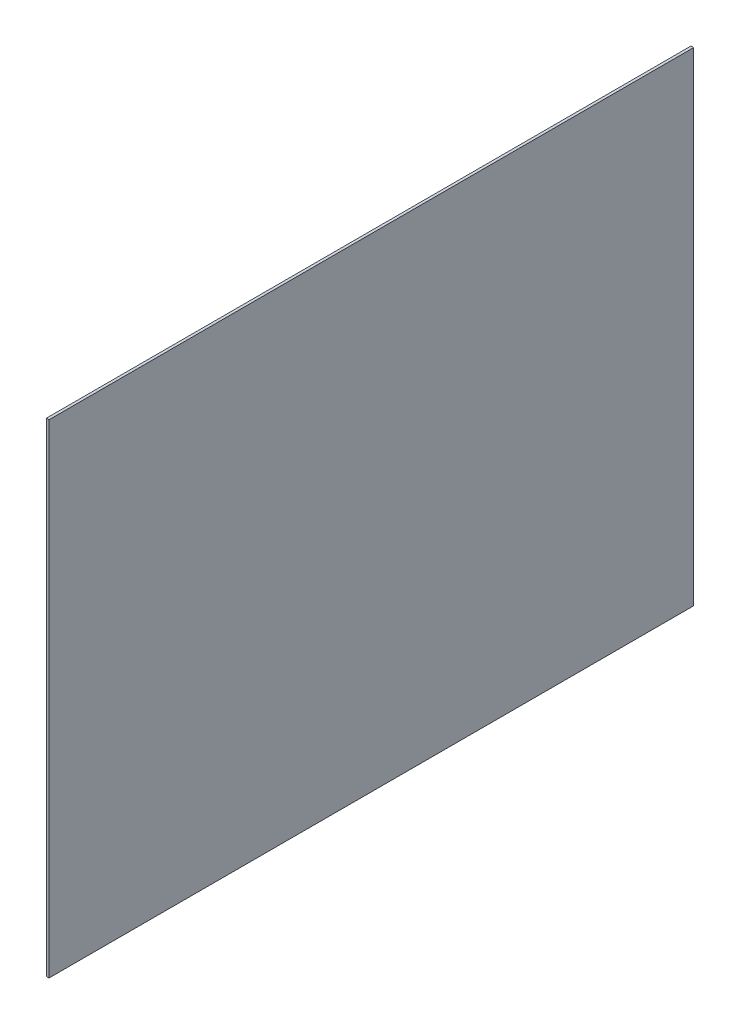
ISO-10303-21;
HEADER;
FILE_DESCRIPTION(('STEP AP214'),'2;1');
FILE_NAME('part.step','',(''),(''),'','','');
FILE_SCHEMA(('AUTOMOTIVE_DESIGN { 1 0 10303 214 1 1 1 1 }'));
ENDSEC;
DATA;
#1=APPLICATION_CONTEXT('core data for automotive mechanical design processes');
#2=APPLICATION_PROTOCOL_DEFINITION('international standard','automotive_design',2000,#1);
#3=PRODUCT_CONTEXT('',#1,'mechanical');
#4=PRODUCT('Part','Part','',(#3));
#5=PRODUCT_RELATED_PRODUCT_CATEGORY('part','',(#4));
#6=PRODUCT_DEFINITION_FORMATION('','',#4);
#7=PRODUCT_DEFINITION_CONTEXT('part definition',#1,'design');
#8=PRODUCT_DEFINITION('design','',#6,#7);
#9=PRODUCT_DEFINITION_SHAPE('','',#8);
#10=(LENGTH_UNIT() NAMED_UNIT(*) SI_UNIT(.MILLI.,.METRE.));
#11=(NAMED_UNIT(*) PLANE_ANGLE_UNIT() SI_UNIT($,.RADIAN.));
#12=(NAMED_UNIT(*) SI_UNIT($,.STERADIAN.) SOLID_ANGLE_UNIT());
#13=UNCERTAINTY_MEASURE_WITH_UNIT(LENGTH_MEASURE(1.E-05),#10,'distance_accuracy_value','');
#14=(GEOMETRIC_REPRESENTATION_CONTEXT(3) GLOBAL_UNCERTAINTY_ASSIGNED_CONTEXT((#13)) GLOBAL_UNIT_ASSIGNED_CONTEXT((#10,
#11,#12)) REPRESENTATION_CONTEXT('',''));
#15=CARTESIAN_POINT('',(0.,0.,0.));
#16=DIRECTION('',(0.,0.,1.));
#17=DIRECTION('',(1.,0.,0.));
#18=AXIS2_PLACEMENT_3D('',#15,#16,#17);
#19=CARTESIAN_POINT('',(2.54,228.6,-304.8));
#20=DIRECTION('',(0.,0.,1.));
#21=DIRECTION('',(1.,0.,0.));
#22=AXIS2_PLACEMENT_3D('',#19,#20,#21);
#23=PLANE('',#22);
#24=DIRECTION('',(0.,1.,0.));
#25=VECTOR('',#24,1.);
#26=CARTESIAN_POINT('',(0.,228.6,-304.8));
#27=LINE('',#26,#25);
#28=CARTESIAN_POINT('',(0.,-228.6,-304.8));
#29=VERTEX_POINT('',#28);
#30=CARTESIAN_POINT('',(0.,228.6,-304.8));
#31=VERTEX_POINT('',#30);
#32=EDGE_CURVE('E96',#29,#31,#27,.T.);
#33=ORIENTED_EDGE('',*,*,#32,.T.);
#34=DIRECTION('',(-1.,0.,0.));
#35=VECTOR('',#34,1.);
#36=CARTESIAN_POINT('',(2.54,228.6,-304.8));
#37=LINE('',#36,#35);
#38=CARTESIAN_POINT('',(2.54,228.6,-304.8));
#39=VERTEX_POINT('',#38);
#40=EDGE_CURVE('E11',#39,#31,#37,.T.);
#41=ORIENTED_EDGE('',*,*,#40,.F.);
#42=DIRECTION('',(0.,1.,0.));
#43=VECTOR('',#42,1.);
#44=CARTESIAN_POINT('',(2.54,228.6,-304.8));
#45=LINE('',#44,#43);
#46=CARTESIAN_POINT('',(2.54,-228.6,-304.8));
#47=VERTEX_POINT('',#46);
#48=EDGE_CURVE('E84',#47,#39,#45,.T.);
#49=ORIENTED_EDGE('',*,*,#48,.F.);
#50=DIRECTION('',(-1.,0.,0.));
#51=VECTOR('',#50,1.);
#52=CARTESIAN_POINT('',(2.54,-228.6,-304.8));
#53=LINE('',#52,#51);
#54=EDGE_CURVE('E92',#47,#29,#53,.T.);
#55=ORIENTED_EDGE('',*,*,#54,.T.);
#56=EDGE_LOOP('',(#33,#41,#49,#55));
#57=FACE_BOUND('',#56,.T.);
#58=ADVANCED_FACE('F33',(#57),#23,.F.);
#59=CARTESIAN_POINT('',(2.54,228.6,304.8));
#60=DIRECTION('',(0.,-1.,0.));
#61=DIRECTION('',(0.,0.,-1.));
#62=AXIS2_PLACEMENT_3D('',#59,#60,#61);
#63=PLANE('',#62);
#64=DIRECTION('',(0.,0.,1.));
#65=VECTOR('',#64,1.);
#66=CARTESIAN_POINT('',(0.,228.6,304.8));
#67=LINE('',#66,#65);
#68=CARTESIAN_POINT('',(0.,228.6,304.8));
#69=VERTEX_POINT('',#68);
#70=EDGE_CURVE('E88',#31,#69,#67,.T.);
#71=ORIENTED_EDGE('',*,*,#70,.T.);
#72=DIRECTION('',(-1.,0.,0.));
#73=VECTOR('',#72,1.);
#74=CARTESIAN_POINT('',(2.54,228.6,304.8));
#75=LINE('',#74,#73);
#76=CARTESIAN_POINT('',(2.54,228.6,304.8));
#77=VERTEX_POINT('',#76);
#78=EDGE_CURVE('E41',#77,#69,#75,.T.);
#79=ORIENTED_EDGE('',*,*,#78,.F.);
#80=DIRECTION('',(0.,0.,1.));
#81=VECTOR('',#80,1.);
#82=CARTESIAN_POINT('',(2.54,228.6,304.8));
#83=LINE('',#82,#81);
#84=EDGE_CURVE('E79',#39,#77,#83,.T.);
#85=ORIENTED_EDGE('',*,*,#84,.F.);
#86=ORIENTED_EDGE('',*,*,#40,.T.);
#87=EDGE_LOOP('',(#71,#79,#85,#86));
#88=FACE_BOUND('',#87,.T.);
#89=ADVANCED_FACE('F87',(#88),#63,.F.);
#90=CARTESIAN_POINT('',(2.54,228.6,304.8));
#91=DIRECTION('',(0.,0.,-1.));
#92=DIRECTION('',(-1.,0.,0.));
#93=AXIS2_PLACEMENT_3D('',#90,#91,#92);
#94=PLANE('',#93);
#95=DIRECTION('',(0.,-1.,0.));
#96=VECTOR('',#95,1.);
#97=CARTESIAN_POINT('',(0.,228.6,304.8));
#98=LINE('',#97,#96);
#99=CARTESIAN_POINT('',(0.,-228.6,304.8));
#100=VERTEX_POINT('',#99);
#101=EDGE_CURVE('E66',#69,#100,#98,.T.);
#102=ORIENTED_EDGE('',*,*,#101,.T.);
#103=DIRECTION('',(-1.,0.,0.));
#104=VECTOR('',#103,1.);
#105=CARTESIAN_POINT('',(2.54,-228.6,304.8));
#106=LINE('',#105,#104);
#107=CARTESIAN_POINT('',(2.54,-228.6,304.8));
#108=VERTEX_POINT('',#107);
#109=EDGE_CURVE('E89',#108,#100,#106,.T.);
#110=ORIENTED_EDGE('',*,*,#109,.F.);
#111=DIRECTION('',(0.,-1.,0.));
#112=VECTOR('',#111,1.);
#113=CARTESIAN_POINT('',(2.54,228.6,304.8));
#114=LINE('',#113,#112);
#115=EDGE_CURVE('E82',#77,#108,#114,.T.);
#116=ORIENTED_EDGE('',*,*,#115,.F.);
#117=ORIENTED_EDGE('',*,*,#78,.T.);
#118=EDGE_LOOP('',(#102,#110,#116,#117));
#119=FACE_BOUND('',#118,.T.);
#120=ADVANCED_FACE('F90',(#119),#94,.F.);
#121=CARTESIAN_POINT('',(2.54,-228.6,304.8));
#122=DIRECTION('',(0.,1.,0.));
#123=DIRECTION('',(0.,0.,1.));
#124=AXIS2_PLACEMENT_3D('',#121,#122,#123);
#125=PLANE('',#124);
#126=DIRECTION('',(0.,0.,-1.));
#127=VECTOR('',#126,1.);
#128=CARTESIAN_POINT('',(0.,-228.6,304.8));
#129=LINE('',#128,#127);
#130=EDGE_CURVE('E72',#100,#29,#129,.T.);
#131=ORIENTED_EDGE('',*,*,#130,.T.);
#132=ORIENTED_EDGE('',*,*,#54,.F.);
#133=DIRECTION('',(0.,0.,-1.));
#134=VECTOR('',#133,1.);
#135=CARTESIAN_POINT('',(2.54,-228.6,304.8));
#136=LINE('',#135,#134);
#137=EDGE_CURVE('E49',#108,#47,#136,.T.);
#138=ORIENTED_EDGE('',*,*,#137,.F.);
#139=ORIENTED_EDGE('',*,*,#109,.T.);
#140=EDGE_LOOP('',(#131,#132,#138,#139));
#141=FACE_BOUND('',#140,.T.);
#142=ADVANCED_FACE('F103',(#141),#125,.F.);
#143=CARTESIAN_POINT('',(2.54,0.,0.));
#144=DIRECTION('',(1.,0.,0.));
#145=DIRECTION('',(0.,0.,-1.));
#146=AXIS2_PLACEMENT_3D('',#143,#144,#145);
#147=PLANE('',#146);
#148=ORIENTED_EDGE('',*,*,#48,.T.);
#149=ORIENTED_EDGE('',*,*,#84,.T.);
#150=ORIENTED_EDGE('',*,*,#115,.T.);
#151=ORIENTED_EDGE('',*,*,#137,.T.);
#152=EDGE_LOOP('',(#148,#149,#150,#151));
#153=FACE_BOUND('',#152,.T.);
#154=ADVANCED_FACE('F80',(#153),#147,.T.);
#155=CARTESIAN_POINT('',(0.,0.,0.));
#156=DIRECTION('',(1.,0.,0.));
#157=DIRECTION('',(0.,0.,-1.));
#158=AXIS2_PLACEMENT_3D('',#155,#156,#157);
#159=PLANE('',#158);
#160=ORIENTED_EDGE('',*,*,#32,.F.);
#161=ORIENTED_EDGE('',*,*,#130,.F.);
#162=ORIENTED_EDGE('',*,*,#101,.F.);
#163=ORIENTED_EDGE('',*,*,#70,.F.);
#164=EDGE_LOOP('',(#160,#161,#162,#163));
#165=FACE_BOUND('',#164,.T.);
#166=ADVANCED_FACE('F106',(#165),#159,.F.);
#167=CLOSED_SHELL('',(#58,#89,#120,#142,#154,#166));
#168=MANIFOLD_SOLID_BREP('B2',#167);
#169=ADVANCED_BREP_SHAPE_REPRESENTATION('',(#18,#168),#14);
#170=SHAPE_DEFINITION_REPRESENTATION(#9,#169);
ENDSEC;
END-ISO-10303-21;
